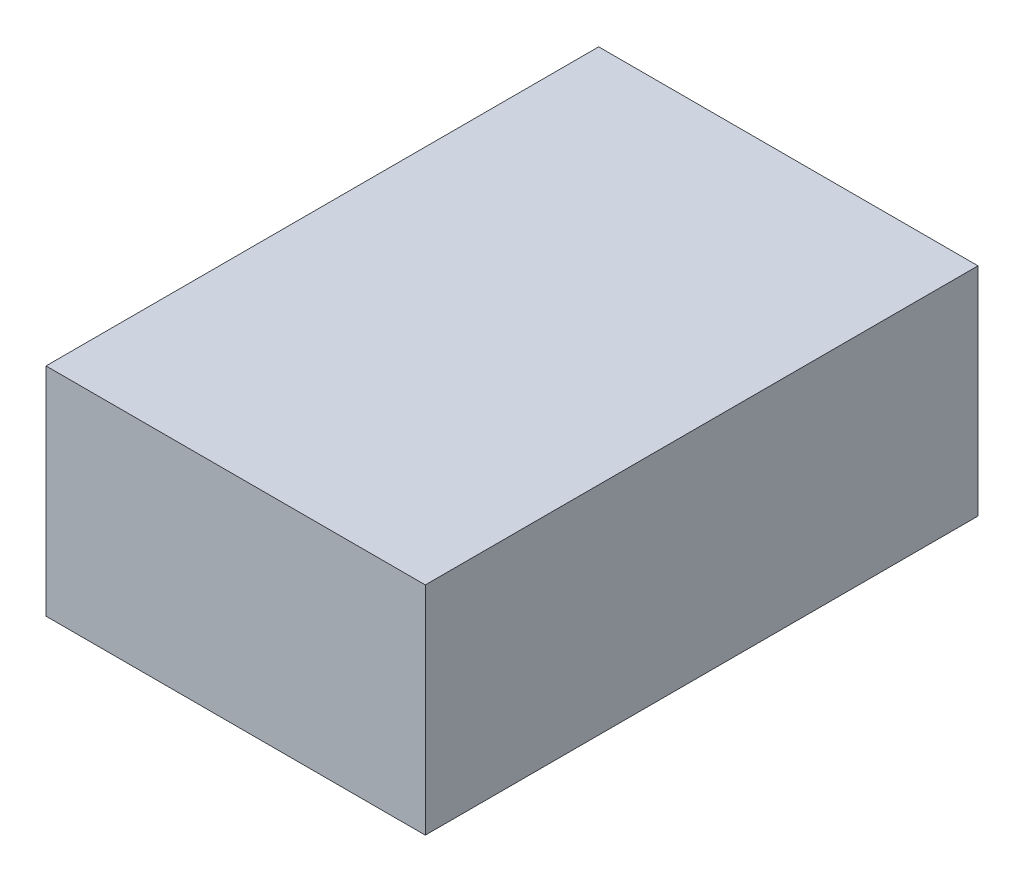
ISO-10303-21;
HEADER;
FILE_DESCRIPTION(('STEP AP214'),'2;1');
FILE_NAME('part.step','',(''),(''),'','','');
FILE_SCHEMA(('AUTOMOTIVE_DESIGN { 1 0 10303 214 1 1 1 1 }'));
ENDSEC;
DATA;
#1=APPLICATION_CONTEXT('core data for automotive mechanical design processes');
#2=APPLICATION_PROTOCOL_DEFINITION('international standard','automotive_design',2000,#1);
#3=PRODUCT_CONTEXT('',#1,'mechanical');
#4=PRODUCT('Part','Part','',(#3));
#5=PRODUCT_RELATED_PRODUCT_CATEGORY('part','',(#4));
#6=PRODUCT_DEFINITION_FORMATION('','',#4);
#7=PRODUCT_DEFINITION_CONTEXT('part definition',#1,'design');
#8=PRODUCT_DEFINITION('design','',#6,#7);
#9=PRODUCT_DEFINITION_SHAPE('','',#8);
#10=(LENGTH_UNIT() NAMED_UNIT(*) SI_UNIT(.MILLI.,.METRE.));
#11=(NAMED_UNIT(*) PLANE_ANGLE_UNIT() SI_UNIT($,.RADIAN.));
#12=(NAMED_UNIT(*) SI_UNIT($,.STERADIAN.) SOLID_ANGLE_UNIT());
#13=UNCERTAINTY_MEASURE_WITH_UNIT(LENGTH_MEASURE(1.E-05),#10,'distance_accuracy_value','');
#14=(GEOMETRIC_REPRESENTATION_CONTEXT(3) GLOBAL_UNCERTAINTY_ASSIGNED_CONTEXT((#13)) GLOBAL_UNIT_ASSIGNED_CONTEXT((#10,
#11,#12)) REPRESENTATION_CONTEXT('',''));
#15=CARTESIAN_POINT('',(0.,0.,0.));
#16=DIRECTION('',(0.,0.,1.));
#17=DIRECTION('',(1.,0.,0.));
#18=AXIS2_PLACEMENT_3D('',#15,#16,#17);
#19=CARTESIAN_POINT('',(0.175,0.2,-0.255));
#20=DIRECTION('',(-1.,0.,0.));
#21=DIRECTION('',(0.,0.,1.));
#22=AXIS2_PLACEMENT_3D('',#19,#20,#21);
#23=PLANE('',#22);
#24=DIRECTION('',(0.,0.,-1.));
#25=VECTOR('',#24,1.);
#26=CARTESIAN_POINT('',(0.175,0.,-0.255));
#27=LINE('',#26,#25);
#28=CARTESIAN_POINT('',(0.175,0.,0.255));
#29=VERTEX_POINT('',#28);
#30=CARTESIAN_POINT('',(0.175,0.,-0.255));
#31=VERTEX_POINT('',#30);
#32=EDGE_CURVE('E100',#29,#31,#27,.T.);
#33=ORIENTED_EDGE('',*,*,#32,.T.);
#34=DIRECTION('',(0.,-1.,0.));
#35=VECTOR('',#34,1.);
#36=CARTESIAN_POINT('',(0.175,0.2,-0.255));
#37=LINE('',#36,#35);
#38=CARTESIAN_POINT('',(0.175,0.2,-0.255));
#39=VERTEX_POINT('',#38);
#40=EDGE_CURVE('E11',#39,#31,#37,.T.);
#41=ORIENTED_EDGE('',*,*,#40,.F.);
#42=DIRECTION('',(0.,0.,-1.));
#43=VECTOR('',#42,1.);
#44=CARTESIAN_POINT('',(0.175,0.2,-0.255));
#45=LINE('',#44,#43);
#46=CARTESIAN_POINT('',(0.175,0.2,0.255));
#47=VERTEX_POINT('',#46);
#48=EDGE_CURVE('E88',#47,#39,#45,.T.);
#49=ORIENTED_EDGE('',*,*,#48,.F.);
#50=DIRECTION('',(0.,-1.,0.));
#51=VECTOR('',#50,1.);
#52=CARTESIAN_POINT('',(0.175,0.2,0.255));
#53=LINE('',#52,#51);
#54=EDGE_CURVE('E96',#47,#29,#53,.T.);
#55=ORIENTED_EDGE('',*,*,#54,.T.);
#56=EDGE_LOOP('',(#33,#41,#49,#55));
#57=FACE_BOUND('',#56,.T.);
#58=ADVANCED_FACE('F37',(#57),#23,.F.);
#59=CARTESIAN_POINT('',(-0.175,0.2,-0.255));
#60=DIRECTION('',(0.,0.,1.));
#61=DIRECTION('',(1.,0.,0.));
#62=AXIS2_PLACEMENT_3D('',#59,#60,#61);
#63=PLANE('',#62);
#64=DIRECTION('',(-1.,0.,0.));
#65=VECTOR('',#64,1.);
#66=CARTESIAN_POINT('',(-0.175,0.,-0.255));
#67=LINE('',#66,#65);
#68=CARTESIAN_POINT('',(-0.175,0.,-0.255));
#69=VERTEX_POINT('',#68);
#70=EDGE_CURVE('E92',#31,#69,#67,.T.);
#71=ORIENTED_EDGE('',*,*,#70,.T.);
#72=DIRECTION('',(0.,-1.,0.));
#73=VECTOR('',#72,1.);
#74=CARTESIAN_POINT('',(-0.175,0.2,-0.255));
#75=LINE('',#74,#73);
#76=CARTESIAN_POINT('',(-0.175,0.2,-0.255));
#77=VERTEX_POINT('',#76);
#78=EDGE_CURVE('E45',#77,#69,#75,.T.);
#79=ORIENTED_EDGE('',*,*,#78,.F.);
#80=DIRECTION('',(-1.,0.,0.));
#81=VECTOR('',#80,1.);
#82=CARTESIAN_POINT('',(-0.175,0.2,-0.255));
#83=LINE('',#82,#81);
#84=EDGE_CURVE('E83',#39,#77,#83,.T.);
#85=ORIENTED_EDGE('',*,*,#84,.F.);
#86=ORIENTED_EDGE('',*,*,#40,.T.);
#87=EDGE_LOOP('',(#71,#79,#85,#86));
#88=FACE_BOUND('',#87,.T.);
#89=ADVANCED_FACE('F91',(#88),#63,.F.);
#90=CARTESIAN_POINT('',(-0.175,0.2,-0.255));
#91=DIRECTION('',(1.,0.,0.));
#92=DIRECTION('',(0.,0.,-1.));
#93=AXIS2_PLACEMENT_3D('',#90,#91,#92);
#94=PLANE('',#93);
#95=DIRECTION('',(0.,0.,1.));
#96=VECTOR('',#95,1.);
#97=CARTESIAN_POINT('',(-0.175,0.,-0.255));
#98=LINE('',#97,#96);
#99=CARTESIAN_POINT('',(-0.175,0.,0.255));
#100=VERTEX_POINT('',#99);
#101=EDGE_CURVE('E70',#69,#100,#98,.T.);
#102=ORIENTED_EDGE('',*,*,#101,.T.);
#103=DIRECTION('',(0.,-1.,0.));
#104=VECTOR('',#103,1.);
#105=CARTESIAN_POINT('',(-0.175,0.2,0.255));
#106=LINE('',#105,#104);
#107=CARTESIAN_POINT('',(-0.175,0.2,0.255));
#108=VERTEX_POINT('',#107);
#109=EDGE_CURVE('E93',#108,#100,#106,.T.);
#110=ORIENTED_EDGE('',*,*,#109,.F.);
#111=DIRECTION('',(0.,0.,1.));
#112=VECTOR('',#111,1.);
#113=CARTESIAN_POINT('',(-0.175,0.2,-0.255));
#114=LINE('',#113,#112);
#115=EDGE_CURVE('E86',#77,#108,#114,.T.);
#116=ORIENTED_EDGE('',*,*,#115,.F.);
#117=ORIENTED_EDGE('',*,*,#78,.T.);
#118=EDGE_LOOP('',(#102,#110,#116,#117));
#119=FACE_BOUND('',#118,.T.);
#120=ADVANCED_FACE('F94',(#119),#94,.F.);
#121=CARTESIAN_POINT('',(-0.175,0.2,0.255));
#122=DIRECTION('',(0.,0.,-1.));
#123=DIRECTION('',(-1.,0.,0.));
#124=AXIS2_PLACEMENT_3D('',#121,#122,#123);
#125=PLANE('',#124);
#126=DIRECTION('',(1.,0.,0.));
#127=VECTOR('',#126,1.);
#128=CARTESIAN_POINT('',(-0.175,0.,0.255));
#129=LINE('',#128,#127);
#130=EDGE_CURVE('E76',#100,#29,#129,.T.);
#131=ORIENTED_EDGE('',*,*,#130,.T.);
#132=ORIENTED_EDGE('',*,*,#54,.F.);
#133=DIRECTION('',(1.,0.,0.));
#134=VECTOR('',#133,1.);
#135=CARTESIAN_POINT('',(-0.175,0.2,0.255));
#136=LINE('',#135,#134);
#137=EDGE_CURVE('E53',#108,#47,#136,.T.);
#138=ORIENTED_EDGE('',*,*,#137,.F.);
#139=ORIENTED_EDGE('',*,*,#109,.T.);
#140=EDGE_LOOP('',(#131,#132,#138,#139));
#141=FACE_BOUND('',#140,.T.);
#142=ADVANCED_FACE('F107',(#141),#125,.F.);
#143=CARTESIAN_POINT('',(0.,0.2,0.));
#144=DIRECTION('',(0.,1.,0.));
#145=DIRECTION('',(0.,0.,1.));
#146=AXIS2_PLACEMENT_3D('',#143,#144,#145);
#147=PLANE('',#146);
#148=ORIENTED_EDGE('',*,*,#48,.T.);
#149=ORIENTED_EDGE('',*,*,#84,.T.);
#150=ORIENTED_EDGE('',*,*,#115,.T.);
#151=ORIENTED_EDGE('',*,*,#137,.T.);
#152=EDGE_LOOP('',(#148,#149,#150,#151));
#153=FACE_BOUND('',#152,.T.);
#154=ADVANCED_FACE('F84',(#153),#147,.T.);
#155=CARTESIAN_POINT('',(0.,0.,0.));
#156=DIRECTION('',(0.,1.,0.));
#157=DIRECTION('',(0.,0.,1.));
#158=AXIS2_PLACEMENT_3D('',#155,#156,#157);
#159=PLANE('',#158);
#160=ORIENTED_EDGE('',*,*,#32,.F.);
#161=ORIENTED_EDGE('',*,*,#130,.F.);
#162=ORIENTED_EDGE('',*,*,#101,.F.);
#163=ORIENTED_EDGE('',*,*,#70,.F.);
#164=EDGE_LOOP('',(#160,#161,#162,#163));
#165=FACE_BOUND('',#164,.T.);
#166=ADVANCED_FACE('F110',(#165),#159,.F.);
#167=CLOSED_SHELL('',(#58,#89,#120,#142,#154,#166));
#168=MANIFOLD_SOLID_BREP('B2',#167);
#169=ADVANCED_BREP_SHAPE_REPRESENTATION('',(#18,#168),#14);
#170=SHAPE_DEFINITION_REPRESENTATION(#9,#169);
ENDSEC;
END-ISO-10303-21;
